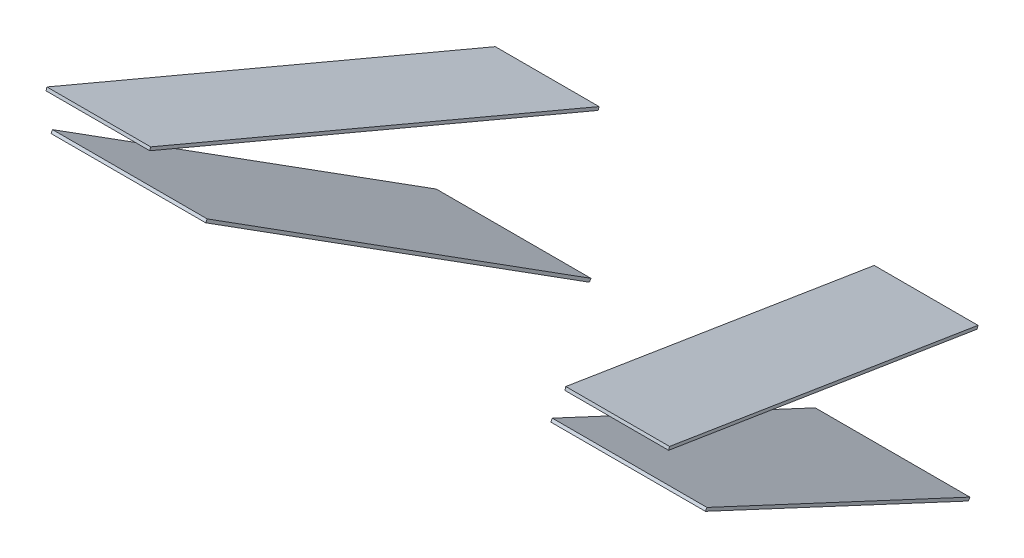
ISO-10303-21;
HEADER;
FILE_DESCRIPTION(('STEP AP214'),'2;1');
FILE_NAME('part.step','',(''),(''),'','','');
FILE_SCHEMA(('AUTOMOTIVE_DESIGN { 1 0 10303 214 1 1 1 1 }'));
ENDSEC;
DATA;
#1=APPLICATION_CONTEXT('core data for automotive mechanical design processes');
#2=APPLICATION_PROTOCOL_DEFINITION('international standard','automotive_design',2000,#1);
#3=PRODUCT_CONTEXT('',#1,'mechanical');
#4=PRODUCT('Part','Part','',(#3));
#5=PRODUCT_RELATED_PRODUCT_CATEGORY('part','',(#4));
#6=PRODUCT_DEFINITION_FORMATION('','',#4);
#7=PRODUCT_DEFINITION_CONTEXT('part definition',#1,'design');
#8=PRODUCT_DEFINITION('design','',#6,#7);
#9=PRODUCT_DEFINITION_SHAPE('','',#8);
#10=(LENGTH_UNIT() NAMED_UNIT(*) SI_UNIT(.MILLI.,.METRE.));
#11=(NAMED_UNIT(*) PLANE_ANGLE_UNIT() SI_UNIT($,.RADIAN.));
#12=(NAMED_UNIT(*) SI_UNIT($,.STERADIAN.) SOLID_ANGLE_UNIT());
#13=UNCERTAINTY_MEASURE_WITH_UNIT(LENGTH_MEASURE(1.E-05),#10,'distance_accuracy_value','');
#14=(GEOMETRIC_REPRESENTATION_CONTEXT(3) GLOBAL_UNCERTAINTY_ASSIGNED_CONTEXT((#13)) GLOBAL_UNIT_ASSIGNED_CONTEXT((#10,
#11,#12)) REPRESENTATION_CONTEXT('',''));
#15=CARTESIAN_POINT('',(0.,0.,0.));
#16=DIRECTION('',(0.,0.,1.));
#17=DIRECTION('',(1.,0.,0.));
#18=AXIS2_PLACEMENT_3D('',#15,#16,#17);
#19=CARTESIAN_POINT('',(-84.8100608166848,295.609668448448,-140.924798143682));
#20=DIRECTION('',(0.987037984141863,0.079027488902921,0.139680613754614));
#21=DIRECTION('',(-0.140118844243058,0.,0.990134692598936));
#22=AXIS2_PLACEMENT_3D('',#19,#20,#21);
#23=PLANE('',#22);
#24=DIRECTION('',(0.160486815225323,-0.486040758108487,-0.859074131606906));
#25=VECTOR('',#24,1.);
#26=CARTESIAN_POINT('',(-84.8100608166848,294.304134904538,-140.186162803527));
#27=LINE('',#26,#25);
#28=CARTESIAN_POINT('',(-84.8100608166848,294.304134904538,-140.186162803527));
#29=VERTEX_POINT('',#28);
#30=CARTESIAN_POINT('',(-55.12,204.386594654468,-299.114877150804));
#31=VERTEX_POINT('',#30);
#32=EDGE_CURVE('E107',#29,#31,#27,.T.);
#33=ORIENTED_EDGE('',*,*,#32,.T.);
#34=DIRECTION('',(0.,-0.870355695939899,0.492423560103468));
#35=VECTOR('',#34,1.);
#36=CARTESIAN_POINT('',(-55.12,205.692128198377,-299.85351249096));
#37=LINE('',#36,#35);
#38=CARTESIAN_POINT('',(-55.12,205.692128198377,-299.85351249096));
#39=VERTEX_POINT('',#38);
#40=EDGE_CURVE('E46',#39,#31,#37,.T.);
#41=ORIENTED_EDGE('',*,*,#40,.F.);
#42=DIRECTION('',(0.160486815225323,-0.486040758108487,-0.859074131606906));
#43=VECTOR('',#42,1.);
#44=CARTESIAN_POINT('',(-84.8100608166848,295.609668448448,-140.924798143682));
#45=LINE('',#44,#43);
#46=CARTESIAN_POINT('',(-84.8100608166848,295.609668448448,-140.924798143682));
#47=VERTEX_POINT('',#46);
#48=EDGE_CURVE('E96',#47,#39,#45,.T.);
#49=ORIENTED_EDGE('',*,*,#48,.F.);
#50=DIRECTION('',(0.,-0.870355695939899,0.492423560103468));
#51=VECTOR('',#50,1.);
#52=CARTESIAN_POINT('',(-84.8100608166848,295.609668448448,-140.924798143682));
#53=LINE('',#52,#51);
#54=EDGE_CURVE('E12',#47,#29,#53,.T.);
#55=ORIENTED_EDGE('',*,*,#54,.T.);
#56=EDGE_LOOP('',(#33,#41,#49,#55));
#57=FACE_BOUND('',#56,.T.);
#58=ADVANCED_FACE('F43',(#57),#23,.T.);
#59=CARTESIAN_POINT('',(-84.8100608166848,295.609668448448,-140.924798143682));
#60=DIRECTION('',(0.,0.492423560103468,0.870355695939899));
#61=DIRECTION('',(0.,-0.870355695939899,0.492423560103468));
#62=AXIS2_PLACEMENT_3D('',#59,#60,#61);
#63=PLANE('',#62);
#64=DIRECTION('',(1.,0.,0.));
#65=VECTOR('',#64,1.);
#66=CARTESIAN_POINT('',(-84.8100608166848,294.304134904538,-140.186162803527));
#67=LINE('',#66,#65);
#68=CARTESIAN_POINT('',(-160.810060816685,294.304134904538,-140.186162803527));
#69=VERTEX_POINT('',#68);
#70=EDGE_CURVE('E84',#69,#29,#67,.T.);
#71=ORIENTED_EDGE('',*,*,#70,.T.);
#72=ORIENTED_EDGE('',*,*,#54,.F.);
#73=DIRECTION('',(1.,0.,0.));
#74=VECTOR('',#73,1.);
#75=CARTESIAN_POINT('',(-84.8100608166848,295.609668448448,-140.924798143682));
#76=LINE('',#75,#74);
#77=CARTESIAN_POINT('',(-160.810060816685,295.609668448448,-140.924798143682));
#78=VERTEX_POINT('',#77);
#79=EDGE_CURVE('E61',#78,#47,#76,.T.);
#80=ORIENTED_EDGE('',*,*,#79,.F.);
#81=DIRECTION('',(0.,-0.870355695939899,0.492423560103468));
#82=VECTOR('',#81,1.);
#83=CARTESIAN_POINT('',(-160.810060816685,295.609668448448,-140.924798143682));
#84=LINE('',#83,#82);
#85=EDGE_CURVE('E52',#78,#69,#84,.T.);
#86=ORIENTED_EDGE('',*,*,#85,.T.);
#87=EDGE_LOOP('',(#71,#72,#80,#86));
#88=FACE_BOUND('',#87,.T.);
#89=ADVANCED_FACE('F113',(#88),#63,.T.);
#90=CARTESIAN_POINT('',(-131.12,205.692128198377,-299.85351249096));
#91=DIRECTION('',(-0.987037984141863,-0.0790274889029211,-0.139680613754614));
#92=DIRECTION('',(0.140118844243058,0.,-0.990134692598936));
#93=AXIS2_PLACEMENT_3D('',#90,#91,#92);
#94=PLANE('',#93);
#95=DIRECTION('',(-0.160486815225323,0.486040758108487,0.859074131606906));
#96=VECTOR('',#95,1.);
#97=CARTESIAN_POINT('',(-131.12,204.386594654468,-299.114877150804));
#98=LINE('',#97,#96);
#99=CARTESIAN_POINT('',(-131.12,204.386594654468,-299.114877150804));
#100=VERTEX_POINT('',#99);
#101=EDGE_CURVE('E78',#100,#69,#98,.T.);
#102=ORIENTED_EDGE('',*,*,#101,.T.);
#103=ORIENTED_EDGE('',*,*,#85,.F.);
#104=DIRECTION('',(-0.160486815225323,0.486040758108487,0.859074131606906));
#105=VECTOR('',#104,1.);
#106=CARTESIAN_POINT('',(-131.12,205.692128198377,-299.85351249096));
#107=LINE('',#106,#105);
#108=CARTESIAN_POINT('',(-131.12,205.692128198377,-299.85351249096));
#109=VERTEX_POINT('',#108);
#110=EDGE_CURVE('E94',#109,#78,#107,.T.);
#111=ORIENTED_EDGE('',*,*,#110,.F.);
#112=DIRECTION('',(0.,-0.870355695939899,0.492423560103468));
#113=VECTOR('',#112,1.);
#114=CARTESIAN_POINT('',(-131.12,205.692128198377,-299.85351249096));
#115=LINE('',#114,#113);
#116=EDGE_CURVE('E99',#109,#100,#115,.T.);
#117=ORIENTED_EDGE('',*,*,#116,.T.);
#118=EDGE_LOOP('',(#102,#103,#111,#117));
#119=FACE_BOUND('',#118,.T.);
#120=ADVANCED_FACE('F102',(#119),#94,.T.);
#121=CARTESIAN_POINT('',(-55.12,205.692128198377,-299.85351249096));
#122=DIRECTION('',(0.,-0.492423560103468,-0.870355695939899));
#123=DIRECTION('',(0.,0.870355695939899,-0.492423560103468));
#124=AXIS2_PLACEMENT_3D('',#121,#122,#123);
#125=PLANE('',#124);
#126=DIRECTION('',(-1.,0.,0.));
#127=VECTOR('',#126,1.);
#128=CARTESIAN_POINT('',(-55.12,204.386594654468,-299.114877150804));
#129=LINE('',#128,#127);
#130=EDGE_CURVE('E101',#31,#100,#129,.T.);
#131=ORIENTED_EDGE('',*,*,#130,.T.);
#132=ORIENTED_EDGE('',*,*,#116,.F.);
#133=DIRECTION('',(-1.,0.,0.));
#134=VECTOR('',#133,1.);
#135=CARTESIAN_POINT('',(-55.12,205.692128198377,-299.85351249096));
#136=LINE('',#135,#134);
#137=EDGE_CURVE('E91',#39,#109,#136,.T.);
#138=ORIENTED_EDGE('',*,*,#137,.F.);
#139=ORIENTED_EDGE('',*,*,#40,.T.);
#140=EDGE_LOOP('',(#131,#132,#138,#139));
#141=FACE_BOUND('',#140,.T.);
#142=ADVANCED_FACE('F100',(#141),#125,.T.);
#143=CARTESIAN_POINT('',(0.,284.328015918872,-160.865051483037));
#144=DIRECTION('',(0.,-0.870355695939899,0.492423560103468));
#145=DIRECTION('',(0.,-0.492423560103468,-0.870355695939899));
#146=AXIS2_PLACEMENT_3D('',#143,#144,#145);
#147=PLANE('',#146);
#148=ORIENTED_EDGE('',*,*,#48,.T.);
#149=ORIENTED_EDGE('',*,*,#137,.T.);
#150=ORIENTED_EDGE('',*,*,#110,.T.);
#151=ORIENTED_EDGE('',*,*,#79,.T.);
#152=EDGE_LOOP('',(#148,#149,#150,#151));
#153=FACE_BOUND('',#152,.T.);
#154=ADVANCED_FACE('F92',(#153),#147,.F.);
#155=CARTESIAN_POINT('',(0.,283.022482374963,-160.126416142882));
#156=DIRECTION('',(0.,-0.870355695939899,0.492423560103468));
#157=DIRECTION('',(0.,-0.492423560103468,-0.870355695939899));
#158=AXIS2_PLACEMENT_3D('',#155,#156,#157);
#159=PLANE('',#158);
#160=ORIENTED_EDGE('',*,*,#32,.F.);
#161=ORIENTED_EDGE('',*,*,#70,.F.);
#162=ORIENTED_EDGE('',*,*,#101,.F.);
#163=ORIENTED_EDGE('',*,*,#130,.F.);
#164=EDGE_LOOP('',(#160,#161,#162,#163));
#165=FACE_BOUND('',#164,.T.);
#166=ADVANCED_FACE('F116',(#165),#159,.T.);
#167=CLOSED_SHELL('',(#58,#89,#120,#142,#154,#166));
#168=MANIFOLD_SOLID_BREP('B2',#167);
#169=CARTESIAN_POINT('',(-102.,322.945822863753,-130.362409379351));
#170=DIRECTION('',(-0.984807753012208,-0.0522170140977948,-0.165611210507492));
#171=DIRECTION('',(0.165837452403587,0.,-0.98615310138958));
#172=AXIS2_PLACEMENT_3D('',#169,#170,#171);
#173=PLANE('',#172);
#174=DIRECTION('',(-0.173648177666931,0.296137402727543,0.939227847276016));
#175=VECTOR('',#174,1.);
#176=CARTESIAN_POINT('',(-102.,321.515247437631,-129.911350680095));
#177=LINE('',#176,#175);
#178=CARTESIAN_POINT('',(-67.6162387618491,262.877616534297,-315.886156075999));
#179=VERTEX_POINT('',#178);
#180=CARTESIAN_POINT('',(-102.,321.515247437631,-129.911350680095));
#181=VERTEX_POINT('',#180);
#182=EDGE_CURVE('E239',#179,#181,#177,.T.);
#183=ORIENTED_EDGE('',*,*,#182,.F.);
#184=DIRECTION('',(0.,-0.953716950748227,0.300705799504274));
#185=VECTOR('',#184,1.);
#186=CARTESIAN_POINT('',(-67.6162387618491,264.30819196042,-316.337214775256));
#187=LINE('',#186,#185);
#188=CARTESIAN_POINT('',(-67.6162387618491,264.30819196042,-316.337214775256));
#189=VERTEX_POINT('',#188);
#190=EDGE_CURVE('E238',#189,#179,#187,.T.);
#191=ORIENTED_EDGE('',*,*,#190,.F.);
#192=DIRECTION('',(-0.173648177666931,0.296137402727543,0.939227847276016));
#193=VECTOR('',#192,1.);
#194=CARTESIAN_POINT('',(-102.,322.945822863753,-130.362409379351));
#195=LINE('',#194,#193);
#196=CARTESIAN_POINT('',(-102.,322.945822863753,-130.362409379351));
#197=VERTEX_POINT('',#196);
#198=EDGE_CURVE('E233',#189,#197,#195,.T.);
#199=ORIENTED_EDGE('',*,*,#198,.T.);
#200=DIRECTION('',(0.,-0.953716950748227,0.300705799504274));
#201=VECTOR('',#200,1.);
#202=CARTESIAN_POINT('',(-102.,322.945822863753,-130.362409379351));
#203=LINE('',#202,#201);
#204=EDGE_CURVE('E41',#197,#181,#203,.T.);
#205=ORIENTED_EDGE('',*,*,#204,.T.);
#206=EDGE_LOOP('',(#183,#191,#199,#205));
#207=FACE_BOUND('',#206,.T.);
#208=ADVANCED_FACE('F176',(#207),#173,.F.);
#209=CARTESIAN_POINT('',(-102.,322.945822863753,-130.362409379351));
#210=DIRECTION('',(0.,-0.300705799504274,-0.953716950748227));
#211=DIRECTION('',(0.,0.953716950748227,-0.300705799504274));
#212=AXIS2_PLACEMENT_3D('',#209,#210,#211);
#213=PLANE('',#212);
#214=DIRECTION('',(-1.,0.,0.));
#215=VECTOR('',#214,1.);
#216=CARTESIAN_POINT('',(-102.,321.515247437631,-129.911350680095));
#217=LINE('',#216,#215);
#218=CARTESIAN_POINT('',(-153.,321.515247437631,-129.911350680095));
#219=VERTEX_POINT('',#218);
#220=EDGE_CURVE('E241',#181,#219,#217,.T.);
#221=ORIENTED_EDGE('',*,*,#220,.F.);
#222=ORIENTED_EDGE('',*,*,#204,.F.);
#223=DIRECTION('',(-1.,0.,0.));
#224=VECTOR('',#223,1.);
#225=CARTESIAN_POINT('',(-102.,322.945822863753,-130.362409379351));
#226=LINE('',#225,#224);
#227=CARTESIAN_POINT('',(-153.,322.945822863753,-130.362409379351));
#228=VERTEX_POINT('',#227);
#229=EDGE_CURVE('E217',#197,#228,#226,.T.);
#230=ORIENTED_EDGE('',*,*,#229,.T.);
#231=DIRECTION('',(0.,-0.953716950748227,0.300705799504274));
#232=VECTOR('',#231,1.);
#233=CARTESIAN_POINT('',(-153.,322.945822863753,-130.362409379351));
#234=LINE('',#233,#232);
#235=EDGE_CURVE('E184',#228,#219,#234,.T.);
#236=ORIENTED_EDGE('',*,*,#235,.T.);
#237=EDGE_LOOP('',(#221,#222,#230,#236));
#238=FACE_BOUND('',#237,.T.);
#239=ADVANCED_FACE('F231',(#238),#213,.F.);
#240=CARTESIAN_POINT('',(-153.,322.945822863753,-130.362409379351));
#241=DIRECTION('',(0.984807753012208,0.0522170140977948,0.165611210507492));
#242=DIRECTION('',(-0.165837452403587,0.,0.98615310138958));
#243=AXIS2_PLACEMENT_3D('',#240,#241,#242);
#244=PLANE('',#243);
#245=DIRECTION('',(0.173648177666931,-0.296137402727543,-0.939227847276016));
#246=VECTOR('',#245,1.);
#247=CARTESIAN_POINT('',(-153.,321.515247437631,-129.911350680095));
#248=LINE('',#247,#246);
#249=CARTESIAN_POINT('',(-118.616238761849,262.877616534297,-315.886156075999));
#250=VERTEX_POINT('',#249);
#251=EDGE_CURVE('E227',#219,#250,#248,.T.);
#252=ORIENTED_EDGE('',*,*,#251,.F.);
#253=ORIENTED_EDGE('',*,*,#235,.F.);
#254=DIRECTION('',(0.173648177666931,-0.296137402727543,-0.939227847276016));
#255=VECTOR('',#254,1.);
#256=CARTESIAN_POINT('',(-153.,322.945822863753,-130.362409379351));
#257=LINE('',#256,#255);
#258=CARTESIAN_POINT('',(-118.616238761849,264.30819196042,-316.337214775256));
#259=VERTEX_POINT('',#258);
#260=EDGE_CURVE('E220',#228,#259,#257,.T.);
#261=ORIENTED_EDGE('',*,*,#260,.T.);
#262=DIRECTION('',(0.,-0.953716950748227,0.300705799504274));
#263=VECTOR('',#262,1.);
#264=CARTESIAN_POINT('',(-118.616238761849,264.30819196042,-316.337214775256));
#265=LINE('',#264,#263);
#266=EDGE_CURVE('E230',#259,#250,#265,.T.);
#267=ORIENTED_EDGE('',*,*,#266,.T.);
#268=EDGE_LOOP('',(#252,#253,#261,#267));
#269=FACE_BOUND('',#268,.T.);
#270=ADVANCED_FACE('F226',(#269),#244,.F.);
#271=CARTESIAN_POINT('',(-67.6162387618491,264.30819196042,-316.337214775256));
#272=DIRECTION('',(0.,0.300705799504274,0.953716950748227));
#273=DIRECTION('',(0.,-0.953716950748227,0.300705799504274));
#274=AXIS2_PLACEMENT_3D('',#271,#272,#273);
#275=PLANE('',#274);
#276=DIRECTION('',(1.,0.,0.));
#277=VECTOR('',#276,1.);
#278=CARTESIAN_POINT('',(-67.6162387618491,262.877616534297,-315.886156075999));
#279=LINE('',#278,#277);
#280=EDGE_CURVE('E206',#250,#179,#279,.T.);
#281=ORIENTED_EDGE('',*,*,#280,.F.);
#282=ORIENTED_EDGE('',*,*,#266,.F.);
#283=DIRECTION('',(1.,0.,0.));
#284=VECTOR('',#283,1.);
#285=CARTESIAN_POINT('',(-67.6162387618491,264.30819196042,-316.337214775256));
#286=LINE('',#285,#284);
#287=EDGE_CURVE('E192',#259,#189,#286,.T.);
#288=ORIENTED_EDGE('',*,*,#287,.T.);
#289=ORIENTED_EDGE('',*,*,#190,.T.);
#290=EDGE_LOOP('',(#281,#282,#288,#289));
#291=FACE_BOUND('',#290,.T.);
#292=ADVANCED_FACE('F250',(#291),#275,.F.);
#293=CARTESIAN_POINT('',(0.,331.130180031566,-104.404944725233));
#294=DIRECTION('',(0.,-0.953716950748227,0.300705799504274));
#295=DIRECTION('',(0.,-0.300705799504274,-0.953716950748227));
#296=AXIS2_PLACEMENT_3D('',#293,#294,#295);
#297=PLANE('',#296);
#298=ORIENTED_EDGE('',*,*,#198,.F.);
#299=ORIENTED_EDGE('',*,*,#287,.F.);
#300=ORIENTED_EDGE('',*,*,#260,.F.);
#301=ORIENTED_EDGE('',*,*,#229,.F.);
#302=EDGE_LOOP('',(#298,#299,#300,#301));
#303=FACE_BOUND('',#302,.T.);
#304=ADVANCED_FACE('F222',(#303),#297,.F.);
#305=CARTESIAN_POINT('',(0.,329.699604605443,-103.953886025976));
#306=DIRECTION('',(0.,-0.953716950748227,0.300705799504274));
#307=DIRECTION('',(0.,-0.300705799504274,-0.953716950748227));
#308=AXIS2_PLACEMENT_3D('',#305,#306,#307);
#309=PLANE('',#308);
#310=ORIENTED_EDGE('',*,*,#182,.T.);
#311=ORIENTED_EDGE('',*,*,#220,.T.);
#312=ORIENTED_EDGE('',*,*,#251,.T.);
#313=ORIENTED_EDGE('',*,*,#280,.T.);
#314=EDGE_LOOP('',(#310,#311,#312,#313));
#315=FACE_BOUND('',#314,.T.);
#316=ADVANCED_FACE('F246',(#315),#309,.T.);
#317=CLOSED_SHELL('',(#208,#239,#270,#292,#304,#316));
#318=MANIFOLD_SOLID_BREP('B6',#317);
#319=CARTESIAN_POINT('',(84.8100608166848,295.609668448448,-140.924798143682));
#320=DIRECTION('',(-0.987037984141863,0.079027488902921,0.139680613754614));
#321=DIRECTION('',(0.140118844243058,0.,0.990134692598936));
#322=AXIS2_PLACEMENT_3D('',#319,#320,#321);
#323=PLANE('',#322);
#324=DIRECTION('',(-0.160486815225323,-0.486040758108487,-0.859074131606906));
#325=VECTOR('',#324,1.);
#326=CARTESIAN_POINT('',(84.8100608166848,294.304134904538,-140.186162803527));
#327=LINE('',#326,#325);
#328=CARTESIAN_POINT('',(84.8100608166848,294.304134904538,-140.186162803527));
#329=VERTEX_POINT('',#328);
#330=CARTESIAN_POINT('',(55.12,204.386594654468,-299.114877150804));
#331=VERTEX_POINT('',#330);
#332=EDGE_CURVE('E372',#329,#331,#327,.T.);
#333=ORIENTED_EDGE('',*,*,#332,.F.);
#334=DIRECTION('',(0.,-0.870355695939899,0.492423560103468));
#335=VECTOR('',#334,1.);
#336=CARTESIAN_POINT('',(84.8100608166848,295.609668448448,-140.924798143682));
#337=LINE('',#336,#335);
#338=CARTESIAN_POINT('',(84.8100608166848,295.609668448448,-140.924798143682));
#339=VERTEX_POINT('',#338);
#340=EDGE_CURVE('E174',#339,#329,#337,.T.);
#341=ORIENTED_EDGE('',*,*,#340,.F.);
#342=DIRECTION('',(-0.160486815225323,-0.486040758108487,-0.859074131606906));
#343=VECTOR('',#342,1.);
#344=CARTESIAN_POINT('',(84.8100608166848,295.609668448448,-140.924798143682));
#345=LINE('',#344,#343);
#346=CARTESIAN_POINT('',(55.12,205.692128198377,-299.85351249096));
#347=VERTEX_POINT('',#346);
#348=EDGE_CURVE('E366',#339,#347,#345,.T.);
#349=ORIENTED_EDGE('',*,*,#348,.T.);
#350=DIRECTION('',(0.,-0.870355695939899,0.492423560103468));
#351=VECTOR('',#350,1.);
#352=CARTESIAN_POINT('',(55.12,205.692128198377,-299.85351249096));
#353=LINE('',#352,#351);
#354=EDGE_CURVE('E311',#347,#331,#353,.T.);
#355=ORIENTED_EDGE('',*,*,#354,.T.);
#356=EDGE_LOOP('',(#333,#341,#349,#355));
#357=FACE_BOUND('',#356,.T.);
#358=ADVANCED_FACE('F308',(#357),#323,.T.);
#359=CARTESIAN_POINT('',(84.8100608166848,295.609668448448,-140.924798143682));
#360=DIRECTION('',(0.,0.492423560103468,0.870355695939899));
#361=DIRECTION('',(0.,-0.870355695939899,0.492423560103468));
#362=AXIS2_PLACEMENT_3D('',#359,#360,#361);
#363=PLANE('',#362);
#364=DIRECTION('',(-1.,0.,0.));
#365=VECTOR('',#364,1.);
#366=CARTESIAN_POINT('',(84.8100608166848,294.304134904538,-140.186162803527));
#367=LINE('',#366,#365);
#368=CARTESIAN_POINT('',(160.810060816685,294.304134904538,-140.186162803527));
#369=VERTEX_POINT('',#368);
#370=EDGE_CURVE('E368',#369,#329,#367,.T.);
#371=ORIENTED_EDGE('',*,*,#370,.F.);
#372=DIRECTION('',(0.,-0.870355695939899,0.492423560103468));
#373=VECTOR('',#372,1.);
#374=CARTESIAN_POINT('',(160.810060816685,295.609668448448,-140.924798143682));
#375=LINE('',#374,#373);
#376=CARTESIAN_POINT('',(160.810060816685,295.609668448448,-140.924798143682));
#377=VERTEX_POINT('',#376);
#378=EDGE_CURVE('E317',#377,#369,#375,.T.);
#379=ORIENTED_EDGE('',*,*,#378,.F.);
#380=DIRECTION('',(-1.,0.,0.));
#381=VECTOR('',#380,1.);
#382=CARTESIAN_POINT('',(84.8100608166848,295.609668448448,-140.924798143682));
#383=LINE('',#382,#381);
#384=EDGE_CURVE('E363',#377,#339,#383,.T.);
#385=ORIENTED_EDGE('',*,*,#384,.T.);
#386=ORIENTED_EDGE('',*,*,#340,.T.);
#387=EDGE_LOOP('',(#371,#379,#385,#386));
#388=FACE_BOUND('',#387,.T.);
#389=ADVANCED_FACE('F382',(#388),#363,.T.);
#390=CARTESIAN_POINT('',(131.12,205.692128198377,-299.85351249096));
#391=DIRECTION('',(0.987037984141863,-0.0790274889029211,-0.139680613754614));
#392=DIRECTION('',(-0.140118844243058,0.,-0.990134692598936));
#393=AXIS2_PLACEMENT_3D('',#390,#391,#392);
#394=PLANE('',#393);
#395=DIRECTION('',(0.160486815225323,0.486040758108487,0.859074131606906));
#396=VECTOR('',#395,1.);
#397=CARTESIAN_POINT('',(131.12,204.386594654468,-299.114877150804));
#398=LINE('',#397,#396);
#399=CARTESIAN_POINT('',(131.12,204.386594654468,-299.114877150804));
#400=VERTEX_POINT('',#399);
#401=EDGE_CURVE('E358',#400,#369,#398,.T.);
#402=ORIENTED_EDGE('',*,*,#401,.F.);
#403=DIRECTION('',(0.,-0.870355695939899,0.492423560103468));
#404=VECTOR('',#403,1.);
#405=CARTESIAN_POINT('',(131.12,205.692128198377,-299.85351249096));
#406=LINE('',#405,#404);
#407=CARTESIAN_POINT('',(131.12,205.692128198377,-299.85351249096));
#408=VERTEX_POINT('',#407);
#409=EDGE_CURVE('E353',#408,#400,#406,.T.);
#410=ORIENTED_EDGE('',*,*,#409,.F.);
#411=DIRECTION('',(0.160486815225323,0.486040758108487,0.859074131606906));
#412=VECTOR('',#411,1.);
#413=CARTESIAN_POINT('',(131.12,205.692128198377,-299.85351249096));
#414=LINE('',#413,#412);
#415=EDGE_CURVE('E356',#408,#377,#414,.T.);
#416=ORIENTED_EDGE('',*,*,#415,.T.);
#417=ORIENTED_EDGE('',*,*,#378,.T.);
#418=EDGE_LOOP('',(#402,#410,#416,#417));
#419=FACE_BOUND('',#418,.T.);
#420=ADVANCED_FACE('F355',(#419),#394,.T.);
#421=CARTESIAN_POINT('',(55.12,205.692128198377,-299.85351249096));
#422=DIRECTION('',(0.,-0.492423560103468,-0.870355695939899));
#423=DIRECTION('',(0.,0.870355695939899,-0.492423560103468));
#424=AXIS2_PLACEMENT_3D('',#421,#422,#423);
#425=PLANE('',#424);
#426=DIRECTION('',(1.,0.,0.));
#427=VECTOR('',#426,1.);
#428=CARTESIAN_POINT('',(55.12,204.386594654468,-299.114877150804));
#429=LINE('',#428,#427);
#430=EDGE_CURVE('E375',#331,#400,#429,.T.);
#431=ORIENTED_EDGE('',*,*,#430,.F.);
#432=ORIENTED_EDGE('',*,*,#354,.F.);
#433=DIRECTION('',(1.,0.,0.));
#434=VECTOR('',#433,1.);
#435=CARTESIAN_POINT('',(55.12,205.692128198377,-299.85351249096));
#436=LINE('',#435,#434);
#437=EDGE_CURVE('E362',#347,#408,#436,.T.);
#438=ORIENTED_EDGE('',*,*,#437,.T.);
#439=ORIENTED_EDGE('',*,*,#409,.T.);
#440=EDGE_LOOP('',(#431,#432,#438,#439));
#441=FACE_BOUND('',#440,.T.);
#442=ADVANCED_FACE('F365',(#441),#425,.T.);
#443=CARTESIAN_POINT('',(0.,284.328015918872,-160.865051483037));
#444=DIRECTION('',(0.,-0.870355695939899,0.492423560103468));
#445=DIRECTION('',(0.,-0.492423560103468,-0.870355695939899));
#446=AXIS2_PLACEMENT_3D('',#443,#444,#445);
#447=PLANE('',#446);
#448=ORIENTED_EDGE('',*,*,#348,.F.);
#449=ORIENTED_EDGE('',*,*,#384,.F.);
#450=ORIENTED_EDGE('',*,*,#415,.F.);
#451=ORIENTED_EDGE('',*,*,#437,.F.);
#452=EDGE_LOOP('',(#448,#449,#450,#451));
#453=FACE_BOUND('',#452,.T.);
#454=ADVANCED_FACE('F361',(#453),#447,.F.);
#455=CARTESIAN_POINT('',(0.,283.022482374963,-160.126416142882));
#456=DIRECTION('',(0.,-0.870355695939899,0.492423560103468));
#457=DIRECTION('',(0.,-0.492423560103468,-0.870355695939899));
#458=AXIS2_PLACEMENT_3D('',#455,#456,#457);
#459=PLANE('',#458);
#460=ORIENTED_EDGE('',*,*,#332,.T.);
#461=ORIENTED_EDGE('',*,*,#430,.T.);
#462=ORIENTED_EDGE('',*,*,#401,.T.);
#463=ORIENTED_EDGE('',*,*,#370,.T.);
#464=EDGE_LOOP('',(#460,#461,#462,#463));
#465=FACE_BOUND('',#464,.T.);
#466=ADVANCED_FACE('F381',(#465),#459,.T.);
#467=CLOSED_SHELL('',(#358,#389,#420,#442,#454,#466));
#468=MANIFOLD_SOLID_BREP('B35',#467);
#469=CARTESIAN_POINT('',(102.,322.945822863753,-130.362409379351));
#470=DIRECTION('',(0.984807753012208,-0.0522170140977948,-0.165611210507492));
#471=DIRECTION('',(-0.165837452403587,0.,-0.98615310138958));
#472=AXIS2_PLACEMENT_3D('',#469,#470,#471);
#473=PLANE('',#472);
#474=DIRECTION('',(0.173648177666931,0.296137402727543,0.939227847276016));
#475=VECTOR('',#474,1.);
#476=CARTESIAN_POINT('',(102.,321.515247437631,-129.911350680095));
#477=LINE('',#476,#475);
#478=CARTESIAN_POINT('',(67.6162387618491,262.877616534297,-315.886156075999));
#479=VERTEX_POINT('',#478);
#480=CARTESIAN_POINT('',(102.,321.515247437631,-129.911350680095));
#481=VERTEX_POINT('',#480);
#482=EDGE_CURVE('E494',#479,#481,#477,.T.);
#483=ORIENTED_EDGE('',*,*,#482,.T.);
#484=DIRECTION('',(0.,-0.953716950748227,0.300705799504274));
#485=VECTOR('',#484,1.);
#486=CARTESIAN_POINT('',(102.,322.945822863753,-130.362409379351));
#487=LINE('',#486,#485);
#488=CARTESIAN_POINT('',(102.,322.945822863753,-130.362409379351));
#489=VERTEX_POINT('',#488);
#490=EDGE_CURVE('E306',#489,#481,#487,.T.);
#491=ORIENTED_EDGE('',*,*,#490,.F.);
#492=DIRECTION('',(0.173648177666931,0.296137402727543,0.939227847276016));
#493=VECTOR('',#492,1.);
#494=CARTESIAN_POINT('',(102.,322.945822863753,-130.362409379351));
#495=LINE('',#494,#493);
#496=CARTESIAN_POINT('',(67.6162387618491,264.30819196042,-316.337214775256));
#497=VERTEX_POINT('',#496);
#498=EDGE_CURVE('E482',#497,#489,#495,.T.);
#499=ORIENTED_EDGE('',*,*,#498,.F.);
#500=DIRECTION('',(0.,-0.953716950748227,0.300705799504274));
#501=VECTOR('',#500,1.);
#502=CARTESIAN_POINT('',(67.6162387618491,264.30819196042,-316.337214775256));
#503=LINE('',#502,#501);
#504=EDGE_CURVE('E490',#497,#479,#503,.T.);
#505=ORIENTED_EDGE('',*,*,#504,.T.);
#506=EDGE_LOOP('',(#483,#491,#499,#505));
#507=FACE_BOUND('',#506,.T.);
#508=ADVANCED_FACE('F431',(#507),#473,.F.);
#509=CARTESIAN_POINT('',(102.,322.945822863753,-130.362409379351));
#510=DIRECTION('',(0.,-0.300705799504274,-0.953716950748227));
#511=DIRECTION('',(0.,0.953716950748227,-0.300705799504274));
#512=AXIS2_PLACEMENT_3D('',#509,#510,#511);
#513=PLANE('',#512);
#514=DIRECTION('',(1.,0.,0.));
#515=VECTOR('',#514,1.);
#516=CARTESIAN_POINT('',(102.,321.515247437631,-129.911350680095));
#517=LINE('',#516,#515);
#518=CARTESIAN_POINT('',(153.,321.515247437631,-129.911350680095));
#519=VERTEX_POINT('',#518);
#520=EDGE_CURVE('E486',#481,#519,#517,.T.);
#521=ORIENTED_EDGE('',*,*,#520,.T.);
#522=DIRECTION('',(0.,-0.953716950748227,0.300705799504274));
#523=VECTOR('',#522,1.);
#524=CARTESIAN_POINT('',(153.,322.945822863753,-130.362409379351));
#525=LINE('',#524,#523);
#526=CARTESIAN_POINT('',(153.,322.945822863753,-130.362409379351));
#527=VERTEX_POINT('',#526);
#528=EDGE_CURVE('E439',#527,#519,#525,.T.);
#529=ORIENTED_EDGE('',*,*,#528,.F.);
#530=DIRECTION('',(1.,0.,0.));
#531=VECTOR('',#530,1.);
#532=CARTESIAN_POINT('',(102.,322.945822863753,-130.362409379351));
#533=LINE('',#532,#531);
#534=EDGE_CURVE('E477',#489,#527,#533,.T.);
#535=ORIENTED_EDGE('',*,*,#534,.F.);
#536=ORIENTED_EDGE('',*,*,#490,.T.);
#537=EDGE_LOOP('',(#521,#529,#535,#536));
#538=FACE_BOUND('',#537,.T.);
#539=ADVANCED_FACE('F485',(#538),#513,.F.);
#540=CARTESIAN_POINT('',(153.,322.945822863753,-130.362409379351));
#541=DIRECTION('',(-0.984807753012208,0.0522170140977948,0.165611210507492));
#542=DIRECTION('',(0.165837452403587,0.,0.98615310138958));
#543=AXIS2_PLACEMENT_3D('',#540,#541,#542);
#544=PLANE('',#543);
#545=DIRECTION('',(-0.173648177666931,-0.296137402727543,-0.939227847276016));
#546=VECTOR('',#545,1.);
#547=CARTESIAN_POINT('',(153.,321.515247437631,-129.911350680095));
#548=LINE('',#547,#546);
#549=CARTESIAN_POINT('',(118.616238761849,262.877616534297,-315.886156075999));
#550=VERTEX_POINT('',#549);
#551=EDGE_CURVE('E464',#519,#550,#548,.T.);
#552=ORIENTED_EDGE('',*,*,#551,.T.);
#553=DIRECTION('',(0.,-0.953716950748227,0.300705799504274));
#554=VECTOR('',#553,1.);
#555=CARTESIAN_POINT('',(118.616238761849,264.30819196042,-316.337214775256));
#556=LINE('',#555,#554);
#557=CARTESIAN_POINT('',(118.616238761849,264.30819196042,-316.337214775256));
#558=VERTEX_POINT('',#557);
#559=EDGE_CURVE('E487',#558,#550,#556,.T.);
#560=ORIENTED_EDGE('',*,*,#559,.F.);
#561=DIRECTION('',(-0.173648177666931,-0.296137402727543,-0.939227847276016));
#562=VECTOR('',#561,1.);
#563=CARTESIAN_POINT('',(153.,322.945822863753,-130.362409379351));
#564=LINE('',#563,#562);
#565=EDGE_CURVE('E480',#527,#558,#564,.T.);
#566=ORIENTED_EDGE('',*,*,#565,.F.);
#567=ORIENTED_EDGE('',*,*,#528,.T.);
#568=EDGE_LOOP('',(#552,#560,#566,#567));
#569=FACE_BOUND('',#568,.T.);
#570=ADVANCED_FACE('F488',(#569),#544,.F.);
#571=CARTESIAN_POINT('',(67.6162387618491,264.30819196042,-316.337214775256));
#572=DIRECTION('',(0.,0.300705799504274,0.953716950748227));
#573=DIRECTION('',(0.,-0.953716950748227,0.300705799504274));
#574=AXIS2_PLACEMENT_3D('',#571,#572,#573);
#575=PLANE('',#574);
#576=DIRECTION('',(-1.,0.,0.));
#577=VECTOR('',#576,1.);
#578=CARTESIAN_POINT('',(67.6162387618491,262.877616534297,-315.886156075999));
#579=LINE('',#578,#577);
#580=EDGE_CURVE('E470',#550,#479,#579,.T.);
#581=ORIENTED_EDGE('',*,*,#580,.T.);
#582=ORIENTED_EDGE('',*,*,#504,.F.);
#583=DIRECTION('',(-1.,0.,0.));
#584=VECTOR('',#583,1.);
#585=CARTESIAN_POINT('',(67.6162387618491,264.30819196042,-316.337214775256));
#586=LINE('',#585,#584);
#587=EDGE_CURVE('E447',#558,#497,#586,.T.);
#588=ORIENTED_EDGE('',*,*,#587,.F.);
#589=ORIENTED_EDGE('',*,*,#559,.T.);
#590=EDGE_LOOP('',(#581,#582,#588,#589));
#591=FACE_BOUND('',#590,.T.);
#592=ADVANCED_FACE('F501',(#591),#575,.F.);
#593=CARTESIAN_POINT('',(0.,331.130180031566,-104.404944725233));
#594=DIRECTION('',(0.,-0.953716950748227,0.300705799504274));
#595=DIRECTION('',(0.,-0.300705799504274,-0.953716950748227));
#596=AXIS2_PLACEMENT_3D('',#593,#594,#595);
#597=PLANE('',#596);
#598=ORIENTED_EDGE('',*,*,#498,.T.);
#599=ORIENTED_EDGE('',*,*,#534,.T.);
#600=ORIENTED_EDGE('',*,*,#565,.T.);
#601=ORIENTED_EDGE('',*,*,#587,.T.);
#602=EDGE_LOOP('',(#598,#599,#600,#601));
#603=FACE_BOUND('',#602,.T.);
#604=ADVANCED_FACE('F478',(#603),#597,.F.);
#605=CARTESIAN_POINT('',(0.,329.699604605443,-103.953886025976));
#606=DIRECTION('',(0.,-0.953716950748227,0.300705799504274));
#607=DIRECTION('',(0.,-0.300705799504274,-0.953716950748227));
#608=AXIS2_PLACEMENT_3D('',#605,#606,#607);
#609=PLANE('',#608);
#610=ORIENTED_EDGE('',*,*,#482,.F.);
#611=ORIENTED_EDGE('',*,*,#580,.F.);
#612=ORIENTED_EDGE('',*,*,#551,.F.);
#613=ORIENTED_EDGE('',*,*,#520,.F.);
#614=EDGE_LOOP('',(#610,#611,#612,#613));
#615=FACE_BOUND('',#614,.T.);
#616=ADVANCED_FACE('F504',(#615),#609,.T.);
#617=CLOSED_SHELL('',(#508,#539,#570,#592,#604,#616));
#618=MANIFOLD_SOLID_BREP('B168',#617);
#619=ADVANCED_BREP_SHAPE_REPRESENTATION('',(#18,#168,#318,#468,#618),#14);
#620=SHAPE_DEFINITION_REPRESENTATION(#9,#619);
ENDSEC;
END-ISO-10303-21;
